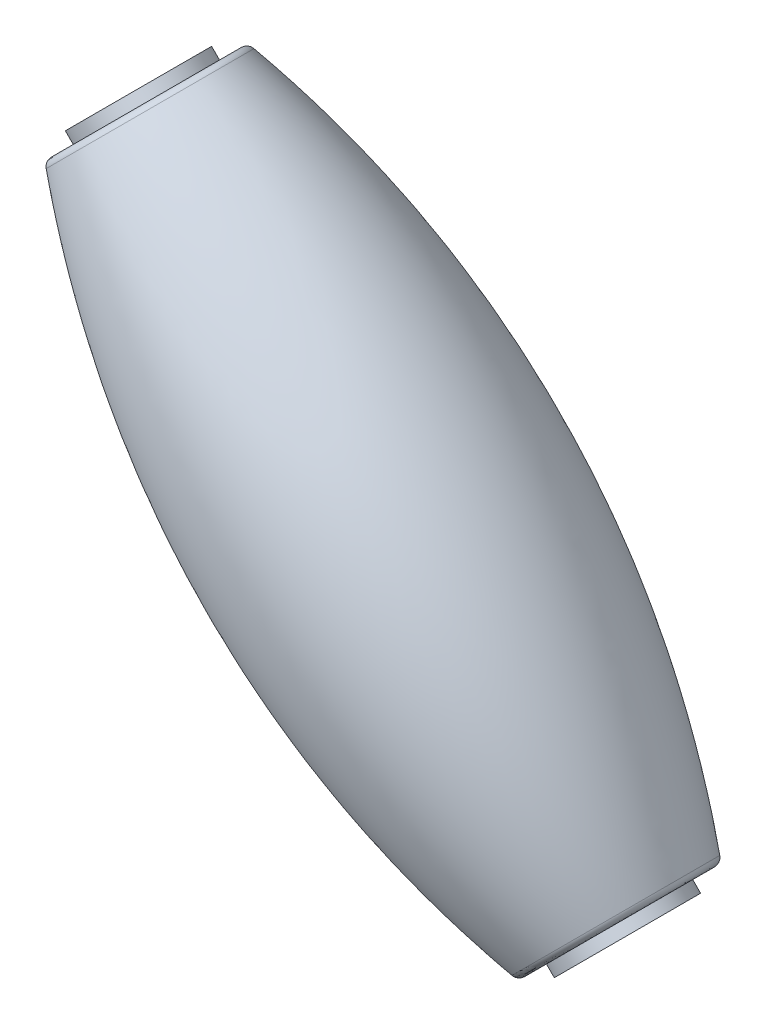
ISO-10303-21;
HEADER;
FILE_DESCRIPTION(('STEP AP214'),'2;1');
FILE_NAME('part.step','',(''),(''),'','','');
FILE_SCHEMA(('AUTOMOTIVE_DESIGN { 1 0 10303 214 1 1 1 1 }'));
ENDSEC;
DATA;
#1=APPLICATION_CONTEXT('core data for automotive mechanical design processes');
#2=APPLICATION_PROTOCOL_DEFINITION('international standard','automotive_design',2000,#1);
#3=PRODUCT_CONTEXT('',#1,'mechanical');
#4=PRODUCT('Part','Part','',(#3));
#5=PRODUCT_RELATED_PRODUCT_CATEGORY('part','',(#4));
#6=PRODUCT_DEFINITION_FORMATION('','',#4);
#7=PRODUCT_DEFINITION_CONTEXT('part definition',#1,'design');
#8=PRODUCT_DEFINITION('design','',#6,#7);
#9=PRODUCT_DEFINITION_SHAPE('','',#8);
#10=(LENGTH_UNIT() NAMED_UNIT(*) SI_UNIT(.MILLI.,.METRE.));
#11=(NAMED_UNIT(*) PLANE_ANGLE_UNIT() SI_UNIT($,.RADIAN.));
#12=(NAMED_UNIT(*) SI_UNIT($,.STERADIAN.) SOLID_ANGLE_UNIT());
#13=UNCERTAINTY_MEASURE_WITH_UNIT(LENGTH_MEASURE(1.E-05),#10,'distance_accuracy_value','');
#14=(GEOMETRIC_REPRESENTATION_CONTEXT(3) GLOBAL_UNCERTAINTY_ASSIGNED_CONTEXT((#13)) GLOBAL_UNIT_ASSIGNED_CONTEXT((#10,
#11,#12)) REPRESENTATION_CONTEXT('',''));
#15=CARTESIAN_POINT('',(0.,0.,0.));
#16=DIRECTION('',(0.,0.,1.));
#17=DIRECTION('',(1.,0.,0.));
#18=AXIS2_PLACEMENT_3D('',#15,#16,#17);
#19=CARTESIAN_POINT('',(22.2665612295965,69.3320512053089,0.));
#20=DIRECTION('',(0.707106781186548,-0.707106781186548,0.));
#21=DIRECTION('',(0.707106781186548,0.707106781186548,0.));
#22=AXIS2_PLACEMENT_3D('',#19,#20,#21);
#23=CYLINDRICAL_SURFACE('',#22,1.5875);
#24=CARTESIAN_POINT('',(26.3121504347326,65.2864620001727,0.));
#25=DIRECTION('',(0.707106781186548,-0.707106781186548,0.));
#26=DIRECTION('',(0.707106781186548,0.707106781186548,0.));
#27=AXIS2_PLACEMENT_3D('',#24,#25,#26);
#28=CIRCLE('',#27,1.5875);
#29=CARTESIAN_POINT('',(27.4346824498663,66.4089940153064,0.));
#30=VERTEX_POINT('',#29);
#31=EDGE_CURVE('E340',#30,#30,#28,.F.);
#32=ORIENTED_EDGE('',*,*,#31,.T.);
#33=EDGE_LOOP('',(#32));
#34=FACE_BOUND('',#33,.T.);
#35=CARTESIAN_POINT('',(65.2864620001728,26.3121504347326,0.));
#36=DIRECTION('',(0.707106781186548,-0.707106781186548,0.));
#37=DIRECTION('',(0.707106781186548,0.707106781186548,0.));
#38=AXIS2_PLACEMENT_3D('',#35,#36,#37);
#39=CIRCLE('',#38,1.5875);
#40=CARTESIAN_POINT('',(66.4089940153064,27.4346824498662,0.));
#41=VERTEX_POINT('',#40);
#42=EDGE_CURVE('E343',#41,#41,#39,.F.);
#43=ORIENTED_EDGE('',*,*,#42,.F.);
#44=EDGE_LOOP('',(#43));
#45=FACE_BOUND('',#44,.T.);
#46=ADVANCED_FACE('F17',(#34,#45),#23,.F.);
#47=CARTESIAN_POINT('',(19.4871557827201,-19.4871557827201,0.));
#48=DIRECTION('',(0.707106781186548,-0.707106781186547,0.));
#49=DIRECTION('',(0.707106781186547,0.707106781186548,0.));
#50=AXIS2_PLACEMENT_3D('',#47,#48,#49);
#51=PLANE('',#50);
#52=CARTESIAN_POINT('',(65.2864620001727,26.3121504347326,0.));
#53=DIRECTION('',(0.707106781186548,-0.707106781186548,0.));
#54=DIRECTION('',(0.707106781186548,0.707106781186548,0.));
#55=AXIS2_PLACEMENT_3D('',#52,#53,#54);
#56=CIRCLE('',#55,4.7625);
#57=CARTESIAN_POINT('',(68.6540580455737,29.6797464801335,0.));
#58=VERTEX_POINT('',#57);
#59=EDGE_CURVE('E335',#58,#58,#56,.F.);
#60=ORIENTED_EDGE('',*,*,#59,.F.);
#61=EDGE_LOOP('',(#60));
#62=FACE_BOUND('',#61,.T.);
#63=ORIENTED_EDGE('',*,*,#42,.T.);
#64=EDGE_LOOP('',(#63));
#65=FACE_BOUND('',#64,.T.);
#66=ADVANCED_FACE('F136',(#62,#65),#51,.T.);
#67=CARTESIAN_POINT('',(26.3121504347326,65.2864620001727,0.));
#68=DIRECTION('',(0.707106781186548,-0.707106781186548,0.));
#69=DIRECTION('',(0.707106781186548,0.707106781186548,0.));
#70=AXIS2_PLACEMENT_3D('',#67,#68,#69);
#71=PLANE('',#70);
#72=CARTESIAN_POINT('',(26.3121504347326,65.2864620001727,0.));
#73=DIRECTION('',(0.707106781186548,-0.707106781186548,0.));
#74=DIRECTION('',(0.707106781186548,0.707106781186548,0.));
#75=AXIS2_PLACEMENT_3D('',#72,#73,#74);
#76=CIRCLE('',#75,4.7625);
#77=CARTESIAN_POINT('',(29.6797464801335,68.6540580455737,0.));
#78=VERTEX_POINT('',#77);
#79=EDGE_CURVE('E332',#78,#78,#76,.T.);
#80=ORIENTED_EDGE('',*,*,#79,.F.);
#81=EDGE_LOOP('',(#80));
#82=FACE_BOUND('',#81,.T.);
#83=ORIENTED_EDGE('',*,*,#31,.F.);
#84=EDGE_LOOP('',(#83));
#85=FACE_BOUND('',#84,.T.);
#86=ADVANCED_FACE('F133',(#82,#85),#71,.F.);
#87=CARTESIAN_POINT('',(16.1585325062578,75.4400799286476,0.));
#88=DIRECTION('',(0.707106781186548,-0.707106781186548,0.));
#89=DIRECTION('',(0.707106781186548,0.707106781186548,0.));
#90=AXIS2_PLACEMENT_3D('',#87,#88,#89);
#91=CYLINDRICAL_SURFACE('',#90,4.7625);
#92=CARTESIAN_POINT('',(64.6578440716979,26.9407683632074,0.));
#93=DIRECTION('',(0.707106781186548,-0.707106781186548,0.));
#94=DIRECTION('',(0.707106781186548,0.707106781186548,0.));
#95=AXIS2_PLACEMENT_3D('',#92,#93,#94);
#96=CIRCLE('',#95,4.7625);
#97=CARTESIAN_POINT('',(68.0254401170988,30.3083644086084,0.));
#98=VERTEX_POINT('',#97);
#99=EDGE_CURVE('E330',#98,#98,#96,.T.);
#100=ORIENTED_EDGE('',*,*,#99,.T.);
#101=EDGE_LOOP('',(#100));
#102=FACE_BOUND('',#101,.T.);
#103=ORIENTED_EDGE('',*,*,#59,.T.);
#104=EDGE_LOOP('',(#103));
#105=FACE_BOUND('',#104,.T.);
#106=ADVANCED_FACE('F129',(#102,#105),#91,.T.);
#107=CARTESIAN_POINT('',(16.1585325062578,75.4400799286476,0.));
#108=DIRECTION('',(0.707106781186548,-0.707106781186548,0.));
#109=DIRECTION('',(0.707106781186548,0.707106781186548,0.));
#110=AXIS2_PLACEMENT_3D('',#107,#108,#109);
#111=CYLINDRICAL_SURFACE('',#110,4.7625);
#112=CARTESIAN_POINT('',(26.9407683632074,64.6578440716979,0.));
#113=DIRECTION('',(0.707106781186548,-0.707106781186548,0.));
#114=DIRECTION('',(0.707106781186548,0.707106781186548,0.));
#115=AXIS2_PLACEMENT_3D('',#112,#113,#114);
#116=CIRCLE('',#115,4.7625);
#117=CARTESIAN_POINT('',(30.3083644086084,68.0254401170988,0.));
#118=VERTEX_POINT('',#117);
#119=EDGE_CURVE('E53',#118,#118,#116,.F.);
#120=ORIENTED_EDGE('',*,*,#119,.T.);
#121=EDGE_LOOP('',(#120));
#122=FACE_BOUND('',#121,.T.);
#123=ORIENTED_EDGE('',*,*,#79,.T.);
#124=EDGE_LOOP('',(#123));
#125=FACE_BOUND('',#124,.T.);
#126=ADVANCED_FACE('F125',(#122,#125),#111,.T.);
#127=CARTESIAN_POINT('',(64.6578440716979,26.9407683632075,0.));
#128=DIRECTION('',(-0.707106781186548,0.707106781186548,0.));
#129=DIRECTION('',(-0.707106781186548,-0.707106781186548,0.));
#130=AXIS2_PLACEMENT_3D('',#127,#128,#129);
#131=PLANE('',#130);
#132=CARTESIAN_POINT('',(64.6578440716979,26.9407683632075,0.));
#133=DIRECTION('',(-0.707106781186548,0.707106781186548,0.));
#134=DIRECTION('',(-0.707106781186547,-0.707106781186547,0.));
#135=AXIS2_PLACEMENT_3D('',#132,#133,#134);
#136=CIRCLE('',#135,6.16833942234622);
#137=CARTESIAN_POINT('',(60.2961694374966,22.5790937290061,0.));
#138=VERTEX_POINT('',#137);
#139=CARTESIAN_POINT('',(69.0195187058992,31.3024429974088,0.));
#140=VERTEX_POINT('',#139);
#141=EDGE_CURVE('E45',#138,#140,#136,.T.);
#142=ORIENTED_EDGE('',*,*,#141,.F.);
#143=CARTESIAN_POINT('',(64.6578440716979,26.9407683632075,0.));
#144=DIRECTION('',(-0.707106781186548,0.707106781186548,0.));
#145=DIRECTION('',(0.707106781186547,0.707106781186547,0.));
#146=AXIS2_PLACEMENT_3D('',#143,#144,#145);
#147=CIRCLE('',#146,6.16833942234622);
#148=EDGE_CURVE('E48',#140,#138,#147,.T.);
#149=ORIENTED_EDGE('',*,*,#148,.F.);
#150=EDGE_LOOP('',(#142,#149));
#151=FACE_BOUND('',#150,.T.);
#152=ORIENTED_EDGE('',*,*,#99,.F.);
#153=EDGE_LOOP('',(#152));
#154=FACE_BOUND('',#153,.T.);
#155=ADVANCED_FACE('F50',(#151,#154),#131,.F.);
#156=CARTESIAN_POINT('',(26.9407683632075,64.6578440716979,0.));
#157=DIRECTION('',(0.707106781186548,-0.707106781186548,0.));
#158=DIRECTION('',(0.707106781186548,0.707106781186548,0.));
#159=AXIS2_PLACEMENT_3D('',#156,#157,#158);
#160=PLANE('',#159);
#161=CARTESIAN_POINT('',(26.9407683632075,64.6578440716979,0.));
#162=DIRECTION('',(0.707106781186548,-0.707106781186548,0.));
#163=DIRECTION('',(0.707106781186547,0.707106781186547,0.));
#164=AXIS2_PLACEMENT_3D('',#161,#162,#163);
#165=CIRCLE('',#164,6.16833942234622);
#166=CARTESIAN_POINT('',(31.3024429974088,69.0195187058992,0.));
#167=VERTEX_POINT('',#166);
#168=CARTESIAN_POINT('',(22.5790937290061,60.2961694374966,0.));
#169=VERTEX_POINT('',#168);
#170=EDGE_CURVE('E58',#167,#169,#165,.T.);
#171=ORIENTED_EDGE('',*,*,#170,.F.);
#172=CARTESIAN_POINT('',(26.9407683632075,64.6578440716979,0.));
#173=DIRECTION('',(0.707106781186548,-0.707106781186548,0.));
#174=DIRECTION('',(-0.707106781186547,-0.707106781186547,0.));
#175=AXIS2_PLACEMENT_3D('',#172,#173,#174);
#176=CIRCLE('',#175,6.16833942234622);
#177=EDGE_CURVE('E36',#169,#167,#176,.T.);
#178=ORIENTED_EDGE('',*,*,#177,.F.);
#179=EDGE_LOOP('',(#171,#178));
#180=FACE_BOUND('',#179,.T.);
#181=ORIENTED_EDGE('',*,*,#119,.F.);
#182=EDGE_LOOP('',(#181));
#183=FACE_BOUND('',#182,.T.);
#184=ADVANCED_FACE('F78',(#180,#183),#160,.F.);
#185=CARTESIAN_POINT('',(64.2088312656444,27.3897811692609,0.));
#186=DIRECTION('',(-0.707106781186548,0.707106781186548,0.));
#187=DIRECTION('',(-0.707106781186547,-0.707106781186547,0.));
#188=AXIS2_PLACEMENT_3D('',#185,#186,#187);
#189=TOROIDAL_SURFACE('',#188,6.16833942234622,0.635);
#190=CARTESIAN_POINT('',(64.3635331568057,27.2350792780996,0.));
#191=DIRECTION('',(-0.707106781186548,0.707106781186548,0.));
#192=DIRECTION('',(-0.707106781186548,-0.707106781186547,0.));
#193=AXIS2_PLACEMENT_3D('',#190,#191,#192);
#194=CIRCLE('',#193,6.76445992169367);
#195=CARTESIAN_POINT('',(59.5803376751115,22.4518837964054,0.));
#196=VERTEX_POINT('',#195);
#197=EDGE_CURVE('E28',#196,#196,#194,.T.);
#198=ORIENTED_EDGE('',*,*,#197,.F.);
#199=EDGE_LOOP('',(#198));
#200=FACE_BOUND('',#199,.T.);
#201=ORIENTED_EDGE('',*,*,#141,.T.);
#202=ORIENTED_EDGE('',*,*,#148,.T.);
#203=EDGE_LOOP('',(#201,#202));
#204=FACE_BOUND('',#203,.T.);
#205=ADVANCED_FACE('F57',(#200,#204),#189,.T.);
#206=CARTESIAN_POINT('',(27.3897811692609,64.2088312656444,0.));
#207=DIRECTION('',(0.707106781186548,-0.707106781186548,0.));
#208=DIRECTION('',(0.707106781186547,0.707106781186547,0.));
#209=AXIS2_PLACEMENT_3D('',#206,#207,#208);
#210=TOROIDAL_SURFACE('',#209,6.16833942234622,0.635);
#211=CARTESIAN_POINT('',(27.2350792780997,64.3635331568057,0.));
#212=DIRECTION('',(-0.707106781186548,0.707106781186548,0.));
#213=DIRECTION('',(-0.707106781186547,-0.707106781186548,0.));
#214=AXIS2_PLACEMENT_3D('',#211,#212,#213);
#215=CIRCLE('',#214,6.76445992169366);
#216=CARTESIAN_POINT('',(22.4518837964054,59.5803376751115,0.));
#217=VERTEX_POINT('',#216);
#218=EDGE_CURVE('E11',#217,#217,#215,.F.);
#219=ORIENTED_EDGE('',*,*,#218,.F.);
#220=EDGE_LOOP('',(#219));
#221=FACE_BOUND('',#220,.T.);
#222=ORIENTED_EDGE('',*,*,#170,.T.);
#223=ORIENTED_EDGE('',*,*,#177,.T.);
#224=EDGE_LOOP('',(#222,#223));
#225=FACE_BOUND('',#224,.T.);
#226=ADVANCED_FACE('F77',(#221,#225),#210,.T.);
#227=CARTESIAN_POINT('',(91.5986124349054,91.5986124349054,0.));
#228=DIRECTION('',(0.,0.,1.));
#229=DIRECTION('',(-0.707106781186548,-0.707106781186548,0.));
#230=AXIS2_PLACEMENT_3D('',#227,#228,#229);
#231=CIRCLE('',#230,76.2);
#232=TRIMMED_CURVE('',#231,(PARAMETER_VALUE(-0.554811032980071)),
(PARAMETER_VALUE(0.554811032980071)),.T.,.PARAMETER.);
#233=CARTESIAN_POINT('',(45.7993062174527,45.7993062174527,0.));
#234=DIRECTION('',(-0.707106781186548,0.707106781186548,0.));
#235=AXIS1_PLACEMENT('',#233,#234);
#236=SURFACE_OF_REVOLUTION('',#232,#235);
#237=ORIENTED_EDGE('',*,*,#218,.T.);
#238=EDGE_LOOP('',(#237));
#239=FACE_BOUND('',#238,.T.);
#240=ORIENTED_EDGE('',*,*,#197,.T.);
#241=EDGE_LOOP('',(#240));
#242=FACE_BOUND('',#241,.T.);
#243=ADVANCED_FACE('F147',(#239,#242),#236,.F.);
#244=CLOSED_SHELL('',(#46,#66,#86,#106,#126,#155,#184,#205,#226,#243));
#245=MANIFOLD_SOLID_BREP('B1',#244);
#246=ADVANCED_BREP_SHAPE_REPRESENTATION('',(#18,#245),#14);
#247=SHAPE_DEFINITION_REPRESENTATION(#9,#246);
ENDSEC;
END-ISO-10303-21;
